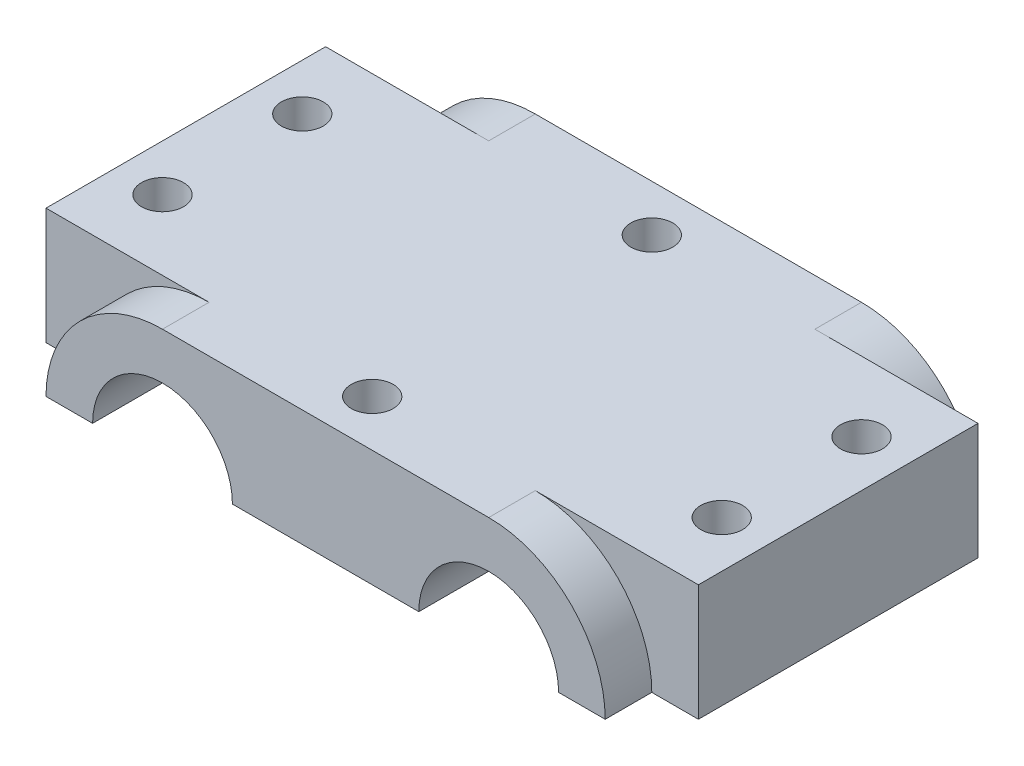
ISO-10303-21;
HEADER;
FILE_DESCRIPTION(('STEP AP214'),'2;1');
FILE_NAME('part.step','',(''),(''),'','','');
FILE_SCHEMA(('AUTOMOTIVE_DESIGN { 1 0 10303 214 1 1 1 1 }'));
ENDSEC;
DATA;
#1=APPLICATION_CONTEXT('core data for automotive mechanical design processes');
#2=APPLICATION_PROTOCOL_DEFINITION('international standard','automotive_design',2000,#1);
#3=PRODUCT_CONTEXT('',#1,'mechanical');
#4=PRODUCT('Part','Part','',(#3));
#5=PRODUCT_RELATED_PRODUCT_CATEGORY('part','',(#4));
#6=PRODUCT_DEFINITION_FORMATION('','',#4);
#7=PRODUCT_DEFINITION_CONTEXT('part definition',#1,'design');
#8=PRODUCT_DEFINITION('design','',#6,#7);
#9=PRODUCT_DEFINITION_SHAPE('','',#8);
#10=(LENGTH_UNIT() NAMED_UNIT(*) SI_UNIT(.MILLI.,.METRE.));
#11=(NAMED_UNIT(*) PLANE_ANGLE_UNIT() SI_UNIT($,.RADIAN.));
#12=(NAMED_UNIT(*) SI_UNIT($,.STERADIAN.) SOLID_ANGLE_UNIT());
#13=UNCERTAINTY_MEASURE_WITH_UNIT(LENGTH_MEASURE(1.E-05),#10,'distance_accuracy_value','');
#14=(GEOMETRIC_REPRESENTATION_CONTEXT(3) GLOBAL_UNCERTAINTY_ASSIGNED_CONTEXT((#13)) GLOBAL_UNIT_ASSIGNED_CONTEXT((#10,
#11,#12)) REPRESENTATION_CONTEXT('',''));
#15=CARTESIAN_POINT('',(0.,0.,0.));
#16=DIRECTION('',(0.,0.,1.));
#17=DIRECTION('',(1.,0.,0.));
#18=AXIS2_PLACEMENT_3D('',#15,#16,#17);
#19=CARTESIAN_POINT('',(0.,-6.25,0.));
#20=DIRECTION('',(0.,-1.,0.));
#21=DIRECTION('',(0.,0.,-1.));
#22=AXIS2_PLACEMENT_3D('',#19,#20,#21);
#23=PLANE('',#22);
#24=CARTESIAN_POINT('',(30.,-6.25,-7.5));
#25=DIRECTION('',(0.,1.,0.));
#26=DIRECTION('',(0.,0.,-1.));
#27=AXIS2_PLACEMENT_3D('',#24,#25,#26);
#28=CIRCLE('',#27,2.25);
#29=CARTESIAN_POINT('',(30.,-6.25,-9.75));
#30=VERTEX_POINT('',#29);
#31=EDGE_CURVE('E330',#30,#30,#28,.T.);
#32=ORIENTED_EDGE('',*,*,#31,.T.);
#33=EDGE_LOOP('',(#32));
#34=FACE_BOUND('',#33,.T.);
#35=CARTESIAN_POINT('',(30.,-6.25,7.5));
#36=DIRECTION('',(0.,1.,0.));
#37=DIRECTION('',(0.,0.,-1.));
#38=AXIS2_PLACEMENT_3D('',#35,#36,#37);
#39=CIRCLE('',#38,2.25);
#40=CARTESIAN_POINT('',(30.,-6.25,5.25));
#41=VERTEX_POINT('',#40);
#42=EDGE_CURVE('E324',#41,#41,#39,.T.);
#43=ORIENTED_EDGE('',*,*,#42,.T.);
#44=EDGE_LOOP('',(#43));
#45=FACE_BOUND('',#44,.T.);
#46=DIRECTION('',(1.,0.,0.));
#47=VECTOR('',#46,1.);
#48=CARTESIAN_POINT('',(0.,-6.25,20.));
#49=LINE('',#48,#47);
#50=CARTESIAN_POINT('',(25.,-6.25,20.));
#51=VERTEX_POINT('',#50);
#52=CARTESIAN_POINT('',(30.,-6.25,20.));
#53=VERTEX_POINT('',#52);
#54=EDGE_CURVE('E182',#51,#53,#49,.T.);
#55=ORIENTED_EDGE('',*,*,#54,.F.);
#56=DIRECTION('',(0.,0.,1.));
#57=VECTOR('',#56,1.);
#58=CARTESIAN_POINT('',(25.,-6.25,-20.));
#59=LINE('',#58,#57);
#60=CARTESIAN_POINT('',(25.,-6.25,-20.));
#61=VERTEX_POINT('',#60);
#62=EDGE_CURVE('E214',#61,#51,#59,.T.);
#63=ORIENTED_EDGE('',*,*,#62,.F.);
#64=DIRECTION('',(1.,0.,0.));
#65=VECTOR('',#64,1.);
#66=CARTESIAN_POINT('',(0.,-6.25,-20.));
#67=LINE('',#66,#65);
#68=CARTESIAN_POINT('',(30.,-6.25,-20.));
#69=VERTEX_POINT('',#68);
#70=EDGE_CURVE('E199',#61,#69,#67,.T.);
#71=ORIENTED_EDGE('',*,*,#70,.T.);
#72=DIRECTION('',(0.,0.,1.));
#73=VECTOR('',#72,1.);
#74=CARTESIAN_POINT('',(30.,-6.25,-20.));
#75=LINE('',#74,#73);
#76=CARTESIAN_POINT('',(30.,-6.25,-15.));
#77=VERTEX_POINT('',#76);
#78=EDGE_CURVE('E210',#69,#77,#75,.T.);
#79=ORIENTED_EDGE('',*,*,#78,.T.);
#80=DIRECTION('',(-1.,0.,0.));
#81=VECTOR('',#80,1.);
#82=CARTESIAN_POINT('',(-35.,-6.25,-15.));
#83=LINE('',#82,#81);
#84=CARTESIAN_POINT('',(35.,-6.25,-15.));
#85=VERTEX_POINT('',#84);
#86=EDGE_CURVE('E249',#85,#77,#83,.T.);
#87=ORIENTED_EDGE('',*,*,#86,.F.);
#88=DIRECTION('',(0.,0.,-1.));
#89=VECTOR('',#88,1.);
#90=CARTESIAN_POINT('',(35.,-6.25,15.));
#91=LINE('',#90,#89);
#92=CARTESIAN_POINT('',(35.,-6.25,15.));
#93=VERTEX_POINT('',#92);
#94=EDGE_CURVE('E233',#93,#85,#91,.T.);
#95=ORIENTED_EDGE('',*,*,#94,.F.);
#96=DIRECTION('',(1.,0.,0.));
#97=VECTOR('',#96,1.);
#98=CARTESIAN_POINT('',(-35.,-6.25,15.));
#99=LINE('',#98,#97);
#100=CARTESIAN_POINT('',(30.,-6.25,15.));
#101=VERTEX_POINT('',#100);
#102=EDGE_CURVE('E254',#101,#93,#99,.T.);
#103=ORIENTED_EDGE('',*,*,#102,.F.);
#104=EDGE_CURVE('E213',#101,#53,#75,.T.);
#105=ORIENTED_EDGE('',*,*,#104,.T.);
#106=EDGE_LOOP('',(#55,#63,#71,#79,#87,#95,#103,#105));
#107=FACE_BOUND('',#106,.T.);
#108=ADVANCED_FACE('F35',(#34,#45,#107),#23,.T.);
#109=CARTESIAN_POINT('',(0.,-6.25,15.));
#110=DIRECTION('',(0.,1.,0.));
#111=DIRECTION('',(0.,0.,-1.));
#112=AXIS2_PLACEMENT_3D('',#109,#110,#111);
#113=CIRCLE('',#112,2.25);
#114=CARTESIAN_POINT('',(0.,-6.25,12.75));
#115=VERTEX_POINT('',#114);
#116=EDGE_CURVE('E341',#115,#115,#113,.T.);
#117=ORIENTED_EDGE('',*,*,#116,.T.);
#118=EDGE_LOOP('',(#117));
#119=FACE_BOUND('',#118,.T.);
#120=CARTESIAN_POINT('',(0.,-6.25,-15.));
#121=DIRECTION('',(0.,1.,0.));
#122=DIRECTION('',(0.,0.,1.));
#123=AXIS2_PLACEMENT_3D('',#120,#121,#122);
#124=CIRCLE('',#123,2.25);
#125=CARTESIAN_POINT('',(0.,-6.25,-12.75));
#126=VERTEX_POINT('',#125);
#127=EDGE_CURVE('E336',#126,#126,#124,.T.);
#128=ORIENTED_EDGE('',*,*,#127,.T.);
#129=EDGE_LOOP('',(#128));
#130=FACE_BOUND('',#129,.T.);
#131=DIRECTION('',(0.,0.,1.));
#132=VECTOR('',#131,1.);
#133=CARTESIAN_POINT('',(10.,-6.25,-20.));
#134=LINE('',#133,#132);
#135=CARTESIAN_POINT('',(10.,-6.25,-20.));
#136=VERTEX_POINT('',#135);
#137=CARTESIAN_POINT('',(10.,-6.25,20.));
#138=VERTEX_POINT('',#137);
#139=EDGE_CURVE('E216',#136,#138,#134,.T.);
#140=ORIENTED_EDGE('',*,*,#139,.T.);
#141=CARTESIAN_POINT('',(-10.,-6.25,20.));
#142=VERTEX_POINT('',#141);
#143=EDGE_CURVE('E183',#142,#138,#49,.T.);
#144=ORIENTED_EDGE('',*,*,#143,.F.);
#145=DIRECTION('',(0.,0.,1.));
#146=VECTOR('',#145,1.);
#147=CARTESIAN_POINT('',(-10.,-6.25,-20.));
#148=LINE('',#147,#146);
#149=CARTESIAN_POINT('',(-10.,-6.25,-20.));
#150=VERTEX_POINT('',#149);
#151=EDGE_CURVE('E218',#150,#142,#148,.T.);
#152=ORIENTED_EDGE('',*,*,#151,.F.);
#153=EDGE_CURVE('E200',#150,#136,#67,.T.);
#154=ORIENTED_EDGE('',*,*,#153,.T.);
#155=EDGE_LOOP('',(#140,#144,#152,#154));
#156=FACE_BOUND('',#155,.T.);
#157=ADVANCED_FACE('F292',(#119,#130,#156),#23,.T.);
#158=CARTESIAN_POINT('',(-35.,6.25,-15.));
#159=DIRECTION('',(0.,0.,1.));
#160=DIRECTION('',(1.,0.,0.));
#161=AXIS2_PLACEMENT_3D('',#158,#159,#160);
#162=PLANE('',#161);
#163=ORIENTED_EDGE('',*,*,#86,.T.);
#164=CARTESIAN_POINT('',(17.5,-6.25,-15.));
#165=DIRECTION('',(0.,0.,1.));
#166=DIRECTION('',(1.,0.,0.));
#167=AXIS2_PLACEMENT_3D('',#164,#165,#166);
#168=CIRCLE('',#167,12.5);
#169=CARTESIAN_POINT('',(17.5,6.25,-15.));
#170=VERTEX_POINT('',#169);
#171=EDGE_CURVE('E230',#77,#170,#168,.T.);
#172=ORIENTED_EDGE('',*,*,#171,.T.);
#173=DIRECTION('',(-1.,0.,0.));
#174=VECTOR('',#173,1.);
#175=CARTESIAN_POINT('',(-35.,6.25,-15.));
#176=LINE('',#175,#174);
#177=CARTESIAN_POINT('',(35.,6.25,-15.));
#178=VERTEX_POINT('',#177);
#179=EDGE_CURVE('E239',#178,#170,#176,.T.);
#180=ORIENTED_EDGE('',*,*,#179,.F.);
#181=DIRECTION('',(0.,-1.,0.));
#182=VECTOR('',#181,1.);
#183=CARTESIAN_POINT('',(35.,6.25,-15.));
#184=LINE('',#183,#182);
#185=EDGE_CURVE('E11',#178,#85,#184,.T.);
#186=ORIENTED_EDGE('',*,*,#185,.T.);
#187=EDGE_LOOP('',(#163,#172,#180,#186));
#188=FACE_BOUND('',#187,.T.);
#189=ADVANCED_FACE('F289',(#188),#162,.F.);
#190=CARTESIAN_POINT('',(-35.,6.25,15.));
#191=DIRECTION('',(0.,0.,-1.));
#192=DIRECTION('',(-1.,0.,0.));
#193=AXIS2_PLACEMENT_3D('',#190,#191,#192);
#194=PLANE('',#193);
#195=DIRECTION('',(1.,0.,0.));
#196=VECTOR('',#195,1.);
#197=CARTESIAN_POINT('',(-35.,6.25,15.));
#198=LINE('',#197,#196);
#199=CARTESIAN_POINT('',(17.5,6.25,15.));
#200=VERTEX_POINT('',#199);
#201=CARTESIAN_POINT('',(35.,6.25,15.));
#202=VERTEX_POINT('',#201);
#203=EDGE_CURVE('E243',#200,#202,#198,.T.);
#204=ORIENTED_EDGE('',*,*,#203,.F.);
#205=CARTESIAN_POINT('',(17.5,-6.25,15.));
#206=DIRECTION('',(0.,0.,-1.));
#207=DIRECTION('',(-1.,0.,0.));
#208=AXIS2_PLACEMENT_3D('',#205,#206,#207);
#209=CIRCLE('',#208,12.5);
#210=EDGE_CURVE('E227',#200,#101,#209,.T.);
#211=ORIENTED_EDGE('',*,*,#210,.T.);
#212=ORIENTED_EDGE('',*,*,#102,.T.);
#213=DIRECTION('',(0.,-1.,0.));
#214=VECTOR('',#213,1.);
#215=CARTESIAN_POINT('',(35.,6.25,15.));
#216=LINE('',#215,#214);
#217=EDGE_CURVE('E245',#202,#93,#216,.T.);
#218=ORIENTED_EDGE('',*,*,#217,.F.);
#219=EDGE_LOOP('',(#204,#211,#212,#218));
#220=FACE_BOUND('',#219,.T.);
#221=ADVANCED_FACE('F278',(#220),#194,.F.);
#222=CARTESIAN_POINT('',(35.,6.25,15.));
#223=DIRECTION('',(-1.,0.,0.));
#224=DIRECTION('',(0.,0.,1.));
#225=AXIS2_PLACEMENT_3D('',#222,#223,#224);
#226=PLANE('',#225);
#227=ORIENTED_EDGE('',*,*,#94,.T.);
#228=ORIENTED_EDGE('',*,*,#185,.F.);
#229=DIRECTION('',(0.,0.,-1.));
#230=VECTOR('',#229,1.);
#231=CARTESIAN_POINT('',(35.,6.25,15.));
#232=LINE('',#231,#230);
#233=EDGE_CURVE('E234',#202,#178,#232,.T.);
#234=ORIENTED_EDGE('',*,*,#233,.F.);
#235=ORIENTED_EDGE('',*,*,#217,.T.);
#236=EDGE_LOOP('',(#227,#228,#234,#235));
#237=FACE_BOUND('',#236,.T.);
#238=ADVANCED_FACE('F37',(#237),#226,.F.);
#239=CARTESIAN_POINT('',(-17.5,6.25,-15.));
#240=VERTEX_POINT('',#239);
#241=CARTESIAN_POINT('',(-35.,6.25,-15.));
#242=VERTEX_POINT('',#241);
#243=EDGE_CURVE('E237',#240,#242,#176,.T.);
#244=ORIENTED_EDGE('',*,*,#243,.F.);
#245=CARTESIAN_POINT('',(-17.5,-6.25,-15.));
#246=DIRECTION('',(0.,0.,1.));
#247=DIRECTION('',(1.,0.,0.));
#248=AXIS2_PLACEMENT_3D('',#245,#246,#247);
#249=CIRCLE('',#248,12.5);
#250=CARTESIAN_POINT('',(-30.,-6.25,-15.));
#251=VERTEX_POINT('',#250);
#252=EDGE_CURVE('E225',#240,#251,#249,.T.);
#253=ORIENTED_EDGE('',*,*,#252,.T.);
#254=CARTESIAN_POINT('',(-35.,-6.25,-15.));
#255=VERTEX_POINT('',#254);
#256=EDGE_CURVE('E248',#251,#255,#83,.T.);
#257=ORIENTED_EDGE('',*,*,#256,.T.);
#258=DIRECTION('',(0.,-1.,0.));
#259=VECTOR('',#258,1.);
#260=CARTESIAN_POINT('',(-35.,6.25,-15.));
#261=LINE('',#260,#259);
#262=EDGE_CURVE('E43',#242,#255,#261,.T.);
#263=ORIENTED_EDGE('',*,*,#262,.F.);
#264=EDGE_LOOP('',(#244,#253,#257,#263));
#265=FACE_BOUND('',#264,.T.);
#266=ADVANCED_FACE('F285',(#265),#162,.F.);
#267=CARTESIAN_POINT('',(-35.,6.25,15.));
#268=DIRECTION('',(1.,0.,0.));
#269=DIRECTION('',(0.,0.,-1.));
#270=AXIS2_PLACEMENT_3D('',#267,#268,#269);
#271=PLANE('',#270);
#272=DIRECTION('',(0.,0.,1.));
#273=VECTOR('',#272,1.);
#274=CARTESIAN_POINT('',(-35.,-6.25,15.));
#275=LINE('',#274,#273);
#276=CARTESIAN_POINT('',(-35.,-6.25,15.));
#277=VERTEX_POINT('',#276);
#278=EDGE_CURVE('E252',#255,#277,#275,.T.);
#279=ORIENTED_EDGE('',*,*,#278,.T.);
#280=DIRECTION('',(0.,-1.,0.));
#281=VECTOR('',#280,1.);
#282=CARTESIAN_POINT('',(-35.,6.25,15.));
#283=LINE('',#282,#281);
#284=CARTESIAN_POINT('',(-35.,6.25,15.));
#285=VERTEX_POINT('',#284);
#286=EDGE_CURVE('E259',#285,#277,#283,.T.);
#287=ORIENTED_EDGE('',*,*,#286,.F.);
#288=DIRECTION('',(0.,0.,1.));
#289=VECTOR('',#288,1.);
#290=CARTESIAN_POINT('',(-35.,6.25,15.));
#291=LINE('',#290,#289);
#292=EDGE_CURVE('E241',#242,#285,#291,.T.);
#293=ORIENTED_EDGE('',*,*,#292,.F.);
#294=ORIENTED_EDGE('',*,*,#262,.T.);
#295=EDGE_LOOP('',(#279,#287,#293,#294));
#296=FACE_BOUND('',#295,.T.);
#297=ADVANCED_FACE('F266',(#296),#271,.F.);
#298=CARTESIAN_POINT('',(-30.,-6.25,15.));
#299=VERTEX_POINT('',#298);
#300=EDGE_CURVE('E238',#277,#299,#99,.T.);
#301=ORIENTED_EDGE('',*,*,#300,.T.);
#302=CARTESIAN_POINT('',(-17.5,-6.25,15.));
#303=DIRECTION('',(0.,0.,-1.));
#304=DIRECTION('',(-1.,0.,0.));
#305=AXIS2_PLACEMENT_3D('',#302,#303,#304);
#306=CIRCLE('',#305,12.5);
#307=CARTESIAN_POINT('',(-17.5,6.25,15.));
#308=VERTEX_POINT('',#307);
#309=EDGE_CURVE('E208',#299,#308,#306,.T.);
#310=ORIENTED_EDGE('',*,*,#309,.T.);
#311=EDGE_CURVE('E154',#285,#308,#198,.T.);
#312=ORIENTED_EDGE('',*,*,#311,.F.);
#313=ORIENTED_EDGE('',*,*,#286,.T.);
#314=EDGE_LOOP('',(#301,#310,#312,#313));
#315=FACE_BOUND('',#314,.T.);
#316=ADVANCED_FACE('F275',(#315),#194,.F.);
#317=CARTESIAN_POINT('',(0.,6.25,0.));
#318=DIRECTION('',(0.,-1.,0.));
#319=DIRECTION('',(0.,0.,-1.));
#320=AXIS2_PLACEMENT_3D('',#317,#318,#319);
#321=PLANE('',#320);
#322=CARTESIAN_POINT('',(0.,6.25,15.));
#323=DIRECTION('',(0.,1.,0.));
#324=DIRECTION('',(0.,0.,-1.));
#325=AXIS2_PLACEMENT_3D('',#322,#323,#324);
#326=CIRCLE('',#325,2.25);
#327=CARTESIAN_POINT('',(0.,6.25,12.75));
#328=VERTEX_POINT('',#327);
#329=EDGE_CURVE('E344',#328,#328,#326,.T.);
#330=ORIENTED_EDGE('',*,*,#329,.F.);
#331=EDGE_LOOP('',(#330));
#332=FACE_BOUND('',#331,.T.);
#333=CARTESIAN_POINT('',(0.,6.25,-15.));
#334=DIRECTION('',(0.,1.,0.));
#335=DIRECTION('',(0.,0.,1.));
#336=AXIS2_PLACEMENT_3D('',#333,#334,#335);
#337=CIRCLE('',#336,2.25);
#338=CARTESIAN_POINT('',(0.,6.25,-12.75));
#339=VERTEX_POINT('',#338);
#340=EDGE_CURVE('E338',#339,#339,#337,.T.);
#341=ORIENTED_EDGE('',*,*,#340,.F.);
#342=EDGE_LOOP('',(#341));
#343=FACE_BOUND('',#342,.T.);
#344=CARTESIAN_POINT('',(30.,6.25,-7.5));
#345=DIRECTION('',(0.,1.,0.));
#346=DIRECTION('',(0.,0.,-1.));
#347=AXIS2_PLACEMENT_3D('',#344,#345,#346);
#348=CIRCLE('',#347,2.25);
#349=CARTESIAN_POINT('',(30.,6.25,-9.75));
#350=VERTEX_POINT('',#349);
#351=EDGE_CURVE('E333',#350,#350,#348,.T.);
#352=ORIENTED_EDGE('',*,*,#351,.F.);
#353=EDGE_LOOP('',(#352));
#354=FACE_BOUND('',#353,.T.);
#355=CARTESIAN_POINT('',(30.,6.25,7.5));
#356=DIRECTION('',(0.,1.,0.));
#357=DIRECTION('',(0.,0.,-1.));
#358=AXIS2_PLACEMENT_3D('',#355,#356,#357);
#359=CIRCLE('',#358,2.25);
#360=CARTESIAN_POINT('',(30.,6.25,5.25));
#361=VERTEX_POINT('',#360);
#362=EDGE_CURVE('E327',#361,#361,#359,.T.);
#363=ORIENTED_EDGE('',*,*,#362,.F.);
#364=EDGE_LOOP('',(#363));
#365=FACE_BOUND('',#364,.T.);
#366=CARTESIAN_POINT('',(-30.,6.25,7.5));
#367=DIRECTION('',(0.,1.,0.));
#368=DIRECTION('',(0.,0.,1.));
#369=AXIS2_PLACEMENT_3D('',#366,#367,#368);
#370=CIRCLE('',#369,2.25);
#371=CARTESIAN_POINT('',(-30.,6.25,9.75));
#372=VERTEX_POINT('',#371);
#373=EDGE_CURVE('E321',#372,#372,#370,.T.);
#374=ORIENTED_EDGE('',*,*,#373,.F.);
#375=EDGE_LOOP('',(#374));
#376=FACE_BOUND('',#375,.T.);
#377=CARTESIAN_POINT('',(-30.,6.25,-7.5));
#378=DIRECTION('',(0.,1.,0.));
#379=DIRECTION('',(0.,0.,1.));
#380=AXIS2_PLACEMENT_3D('',#377,#378,#379);
#381=CIRCLE('',#380,2.25);
#382=CARTESIAN_POINT('',(-30.,6.25,-5.25));
#383=VERTEX_POINT('',#382);
#384=EDGE_CURVE('E176',#383,#383,#381,.T.);
#385=ORIENTED_EDGE('',*,*,#384,.F.);
#386=EDGE_LOOP('',(#385));
#387=FACE_BOUND('',#386,.T.);
#388=ORIENTED_EDGE('',*,*,#179,.T.);
#389=DIRECTION('',(0.,0.,1.));
#390=VECTOR('',#389,1.);
#391=CARTESIAN_POINT('',(17.5,6.25,-20.));
#392=LINE('',#391,#390);
#393=CARTESIAN_POINT('',(17.5,6.25,-20.));
#394=VERTEX_POINT('',#393);
#395=EDGE_CURVE('E206',#394,#170,#392,.T.);
#396=ORIENTED_EDGE('',*,*,#395,.F.);
#397=DIRECTION('',(-1.,0.,0.));
#398=VECTOR('',#397,1.);
#399=CARTESIAN_POINT('',(0.,6.25,-20.));
#400=LINE('',#399,#398);
#401=CARTESIAN_POINT('',(-17.5,6.25,-20.));
#402=VERTEX_POINT('',#401);
#403=EDGE_CURVE('E190',#394,#402,#400,.T.);
#404=ORIENTED_EDGE('',*,*,#403,.T.);
#405=DIRECTION('',(0.,0.,1.));
#406=VECTOR('',#405,1.);
#407=CARTESIAN_POINT('',(-17.5,6.25,-20.));
#408=LINE('',#407,#406);
#409=EDGE_CURVE('E155',#402,#240,#408,.T.);
#410=ORIENTED_EDGE('',*,*,#409,.T.);
#411=ORIENTED_EDGE('',*,*,#243,.T.);
#412=ORIENTED_EDGE('',*,*,#292,.T.);
#413=ORIENTED_EDGE('',*,*,#311,.T.);
#414=CARTESIAN_POINT('',(-17.5,6.25,20.));
#415=VERTEX_POINT('',#414);
#416=EDGE_CURVE('E50',#308,#415,#408,.T.);
#417=ORIENTED_EDGE('',*,*,#416,.T.);
#418=DIRECTION('',(-1.,0.,0.));
#419=VECTOR('',#418,1.);
#420=CARTESIAN_POINT('',(0.,6.25,20.));
#421=LINE('',#420,#419);
#422=CARTESIAN_POINT('',(17.5,6.25,20.));
#423=VERTEX_POINT('',#422);
#424=EDGE_CURVE('E152',#423,#415,#421,.T.);
#425=ORIENTED_EDGE('',*,*,#424,.F.);
#426=EDGE_CURVE('E209',#200,#423,#392,.T.);
#427=ORIENTED_EDGE('',*,*,#426,.F.);
#428=ORIENTED_EDGE('',*,*,#203,.T.);
#429=ORIENTED_EDGE('',*,*,#233,.T.);
#430=EDGE_LOOP('',(#388,#396,#404,#410,#411,#412,#413,#417,#425,#427,#428,#429));
#431=FACE_BOUND('',#430,.T.);
#432=ADVANCED_FACE('F149',(#332,#343,#354,#365,#376,#387,#431),#321,.F.);
#433=CARTESIAN_POINT('',(-30.,-6.25,7.5));
#434=DIRECTION('',(0.,1.,0.));
#435=DIRECTION('',(0.,0.,1.));
#436=AXIS2_PLACEMENT_3D('',#433,#434,#435);
#437=CIRCLE('',#436,2.25);
#438=CARTESIAN_POINT('',(-30.,-6.25,9.75));
#439=VERTEX_POINT('',#438);
#440=EDGE_CURVE('E309',#439,#439,#437,.T.);
#441=ORIENTED_EDGE('',*,*,#440,.T.);
#442=EDGE_LOOP('',(#441));
#443=FACE_BOUND('',#442,.T.);
#444=CARTESIAN_POINT('',(-30.,-6.25,-7.5));
#445=DIRECTION('',(0.,1.,0.));
#446=DIRECTION('',(0.,0.,1.));
#447=AXIS2_PLACEMENT_3D('',#444,#445,#446);
#448=CIRCLE('',#447,2.25);
#449=CARTESIAN_POINT('',(-30.,-6.25,-5.25));
#450=VERTEX_POINT('',#449);
#451=EDGE_CURVE('E173',#450,#450,#448,.T.);
#452=ORIENTED_EDGE('',*,*,#451,.T.);
#453=EDGE_LOOP('',(#452));
#454=FACE_BOUND('',#453,.T.);
#455=DIRECTION('',(0.,0.,1.));
#456=VECTOR('',#455,1.);
#457=CARTESIAN_POINT('',(-25.,-6.25,-20.));
#458=LINE('',#457,#456);
#459=CARTESIAN_POINT('',(-25.,-6.25,-20.));
#460=VERTEX_POINT('',#459);
#461=CARTESIAN_POINT('',(-25.,-6.25,20.));
#462=VERTEX_POINT('',#461);
#463=EDGE_CURVE('E220',#460,#462,#458,.T.);
#464=ORIENTED_EDGE('',*,*,#463,.T.);
#465=CARTESIAN_POINT('',(-30.,-6.25,20.));
#466=VERTEX_POINT('',#465);
#467=EDGE_CURVE('E166',#466,#462,#49,.T.);
#468=ORIENTED_EDGE('',*,*,#467,.F.);
#469=DIRECTION('',(0.,0.,1.));
#470=VECTOR('',#469,1.);
#471=CARTESIAN_POINT('',(-30.,-6.25,-20.));
#472=LINE('',#471,#470);
#473=EDGE_CURVE('E162',#299,#466,#472,.T.);
#474=ORIENTED_EDGE('',*,*,#473,.F.);
#475=ORIENTED_EDGE('',*,*,#300,.F.);
#476=ORIENTED_EDGE('',*,*,#278,.F.);
#477=ORIENTED_EDGE('',*,*,#256,.F.);
#478=CARTESIAN_POINT('',(-30.,-6.25,-20.));
#479=VERTEX_POINT('',#478);
#480=EDGE_CURVE('E58',#479,#251,#472,.T.);
#481=ORIENTED_EDGE('',*,*,#480,.F.);
#482=EDGE_CURVE('E195',#479,#460,#67,.T.);
#483=ORIENTED_EDGE('',*,*,#482,.T.);
#484=EDGE_LOOP('',(#464,#468,#474,#475,#476,#477,#481,#483));
#485=FACE_BOUND('',#484,.T.);
#486=ADVANCED_FACE('F273',(#443,#454,#485),#23,.T.);
#487=CARTESIAN_POINT('',(0.,0.,20.));
#488=DIRECTION('',(0.,0.,1.));
#489=DIRECTION('',(1.,0.,0.));
#490=AXIS2_PLACEMENT_3D('',#487,#488,#489);
#491=PLANE('',#490);
#492=ORIENTED_EDGE('',*,*,#424,.T.);
#493=CARTESIAN_POINT('',(-17.5,-6.25,20.));
#494=DIRECTION('',(0.,0.,1.));
#495=DIRECTION('',(1.,0.,0.));
#496=AXIS2_PLACEMENT_3D('',#493,#494,#495);
#497=CIRCLE('',#496,12.5);
#498=EDGE_CURVE('E159',#415,#466,#497,.T.);
#499=ORIENTED_EDGE('',*,*,#498,.T.);
#500=ORIENTED_EDGE('',*,*,#467,.T.);
#501=CARTESIAN_POINT('',(-17.5,-6.25,20.));
#502=DIRECTION('',(0.,0.,1.));
#503=DIRECTION('',(1.,0.,0.));
#504=AXIS2_PLACEMENT_3D('',#501,#502,#503);
#505=CIRCLE('',#504,7.5);
#506=EDGE_CURVE('E181',#142,#462,#505,.T.);
#507=ORIENTED_EDGE('',*,*,#506,.F.);
#508=ORIENTED_EDGE('',*,*,#143,.T.);
#509=CARTESIAN_POINT('',(17.5,-6.25,20.));
#510=DIRECTION('',(0.,0.,1.));
#511=DIRECTION('',(1.,0.,0.));
#512=AXIS2_PLACEMENT_3D('',#509,#510,#511);
#513=CIRCLE('',#512,7.5);
#514=EDGE_CURVE('E186',#51,#138,#513,.T.);
#515=ORIENTED_EDGE('',*,*,#514,.F.);
#516=ORIENTED_EDGE('',*,*,#54,.T.);
#517=CARTESIAN_POINT('',(17.5,-6.25,20.));
#518=DIRECTION('',(0.,0.,1.));
#519=DIRECTION('',(1.,0.,0.));
#520=AXIS2_PLACEMENT_3D('',#517,#518,#519);
#521=CIRCLE('',#520,12.5);
#522=EDGE_CURVE('E172',#53,#423,#521,.T.);
#523=ORIENTED_EDGE('',*,*,#522,.T.);
#524=EDGE_LOOP('',(#492,#499,#500,#507,#508,#515,#516,#523));
#525=FACE_BOUND('',#524,.T.);
#526=ADVANCED_FACE('F169',(#525),#491,.T.);
#527=CARTESIAN_POINT('',(-17.5,-6.25,-20.));
#528=DIRECTION('',(0.,0.,1.));
#529=DIRECTION('',(1.,0.,0.));
#530=AXIS2_PLACEMENT_3D('',#527,#528,#529);
#531=CYLINDRICAL_SURFACE('',#530,12.5);
#532=ORIENTED_EDGE('',*,*,#309,.F.);
#533=ORIENTED_EDGE('',*,*,#473,.T.);
#534=ORIENTED_EDGE('',*,*,#498,.F.);
#535=ORIENTED_EDGE('',*,*,#416,.F.);
#536=EDGE_LOOP('',(#532,#533,#534,#535));
#537=FACE_BOUND('',#536,.T.);
#538=ADVANCED_FACE('F160',(#537),#531,.T.);
#539=CARTESIAN_POINT('',(17.5,-6.25,-20.));
#540=DIRECTION('',(0.,0.,1.));
#541=DIRECTION('',(1.,0.,0.));
#542=AXIS2_PLACEMENT_3D('',#539,#540,#541);
#543=CYLINDRICAL_SURFACE('',#542,12.5);
#544=ORIENTED_EDGE('',*,*,#210,.F.);
#545=ORIENTED_EDGE('',*,*,#426,.T.);
#546=ORIENTED_EDGE('',*,*,#522,.F.);
#547=ORIENTED_EDGE('',*,*,#104,.F.);
#548=EDGE_LOOP('',(#544,#545,#546,#547));
#549=FACE_BOUND('',#548,.T.);
#550=ADVANCED_FACE('F386',(#549),#543,.T.);
#551=ORIENTED_EDGE('',*,*,#171,.F.);
#552=ORIENTED_EDGE('',*,*,#78,.F.);
#553=CARTESIAN_POINT('',(17.5,-6.25,-20.));
#554=DIRECTION('',(0.,0.,1.));
#555=DIRECTION('',(1.,0.,0.));
#556=AXIS2_PLACEMENT_3D('',#553,#554,#555);
#557=CIRCLE('',#556,12.5);
#558=EDGE_CURVE('E156',#69,#394,#557,.T.);
#559=ORIENTED_EDGE('',*,*,#558,.T.);
#560=ORIENTED_EDGE('',*,*,#395,.T.);
#561=EDGE_LOOP('',(#551,#552,#559,#560));
#562=FACE_BOUND('',#561,.T.);
#563=ADVANCED_FACE('F382',(#562),#543,.T.);
#564=CARTESIAN_POINT('',(17.5,-6.25,-20.));
#565=DIRECTION('',(0.,0.,1.));
#566=DIRECTION('',(1.,0.,0.));
#567=AXIS2_PLACEMENT_3D('',#564,#565,#566);
#568=CYLINDRICAL_SURFACE('',#567,7.5);
#569=ORIENTED_EDGE('',*,*,#62,.T.);
#570=ORIENTED_EDGE('',*,*,#514,.T.);
#571=ORIENTED_EDGE('',*,*,#139,.F.);
#572=CARTESIAN_POINT('',(17.5,-6.25,-20.));
#573=DIRECTION('',(0.,0.,1.));
#574=DIRECTION('',(1.,0.,0.));
#575=AXIS2_PLACEMENT_3D('',#572,#573,#574);
#576=CIRCLE('',#575,7.5);
#577=EDGE_CURVE('E202',#61,#136,#576,.T.);
#578=ORIENTED_EDGE('',*,*,#577,.F.);
#579=EDGE_LOOP('',(#569,#570,#571,#578));
#580=FACE_BOUND('',#579,.T.);
#581=ADVANCED_FACE('F385',(#580),#568,.F.);
#582=CARTESIAN_POINT('',(-17.5,-6.25,-20.));
#583=DIRECTION('',(0.,0.,1.));
#584=DIRECTION('',(1.,0.,0.));
#585=AXIS2_PLACEMENT_3D('',#582,#583,#584);
#586=CYLINDRICAL_SURFACE('',#585,7.5);
#587=ORIENTED_EDGE('',*,*,#151,.T.);
#588=ORIENTED_EDGE('',*,*,#506,.T.);
#589=ORIENTED_EDGE('',*,*,#463,.F.);
#590=CARTESIAN_POINT('',(-17.5,-6.25,-20.));
#591=DIRECTION('',(0.,0.,1.));
#592=DIRECTION('',(1.,0.,0.));
#593=AXIS2_PLACEMENT_3D('',#590,#591,#592);
#594=CIRCLE('',#593,7.5);
#595=EDGE_CURVE('E198',#150,#460,#594,.T.);
#596=ORIENTED_EDGE('',*,*,#595,.F.);
#597=EDGE_LOOP('',(#587,#588,#589,#596));
#598=FACE_BOUND('',#597,.T.);
#599=ADVANCED_FACE('F390',(#598),#586,.F.);
#600=ORIENTED_EDGE('',*,*,#252,.F.);
#601=ORIENTED_EDGE('',*,*,#409,.F.);
#602=CARTESIAN_POINT('',(-17.5,-6.25,-20.));
#603=DIRECTION('',(0.,0.,1.));
#604=DIRECTION('',(1.,0.,0.));
#605=AXIS2_PLACEMENT_3D('',#602,#603,#604);
#606=CIRCLE('',#605,12.5);
#607=EDGE_CURVE('E193',#402,#479,#606,.T.);
#608=ORIENTED_EDGE('',*,*,#607,.T.);
#609=ORIENTED_EDGE('',*,*,#480,.T.);
#610=EDGE_LOOP('',(#600,#601,#608,#609));
#611=FACE_BOUND('',#610,.T.);
#612=ADVANCED_FACE('F380',(#611),#531,.T.);
#613=CARTESIAN_POINT('',(0.,0.,-20.));
#614=DIRECTION('',(0.,0.,1.));
#615=DIRECTION('',(1.,0.,0.));
#616=AXIS2_PLACEMENT_3D('',#613,#614,#615);
#617=PLANE('',#616);
#618=ORIENTED_EDGE('',*,*,#403,.F.);
#619=ORIENTED_EDGE('',*,*,#558,.F.);
#620=ORIENTED_EDGE('',*,*,#70,.F.);
#621=ORIENTED_EDGE('',*,*,#577,.T.);
#622=ORIENTED_EDGE('',*,*,#153,.F.);
#623=ORIENTED_EDGE('',*,*,#595,.T.);
#624=ORIENTED_EDGE('',*,*,#482,.F.);
#625=ORIENTED_EDGE('',*,*,#607,.F.);
#626=EDGE_LOOP('',(#618,#619,#620,#621,#622,#623,#624,#625));
#627=FACE_BOUND('',#626,.T.);
#628=ADVANCED_FACE('F316',(#627),#617,.F.);
#629=CARTESIAN_POINT('',(-30.,-6.25,-7.5));
#630=DIRECTION('',(0.,1.,0.));
#631=DIRECTION('',(0.,0.,1.));
#632=AXIS2_PLACEMENT_3D('',#629,#630,#631);
#633=CYLINDRICAL_SURFACE('',#632,2.25);
#634=ORIENTED_EDGE('',*,*,#451,.F.);
#635=EDGE_LOOP('',(#634));
#636=FACE_BOUND('',#635,.T.);
#637=ORIENTED_EDGE('',*,*,#384,.T.);
#638=EDGE_LOOP('',(#637));
#639=FACE_BOUND('',#638,.T.);
#640=ADVANCED_FACE('F312',(#636,#639),#633,.F.);
#641=CARTESIAN_POINT('',(-30.,-6.25,7.5));
#642=DIRECTION('',(0.,1.,0.));
#643=DIRECTION('',(0.,0.,1.));
#644=AXIS2_PLACEMENT_3D('',#641,#642,#643);
#645=CYLINDRICAL_SURFACE('',#644,2.25);
#646=ORIENTED_EDGE('',*,*,#440,.F.);
#647=EDGE_LOOP('',(#646));
#648=FACE_BOUND('',#647,.T.);
#649=ORIENTED_EDGE('',*,*,#373,.T.);
#650=EDGE_LOOP('',(#649));
#651=FACE_BOUND('',#650,.T.);
#652=ADVANCED_FACE('F315',(#648,#651),#645,.F.);
#653=CARTESIAN_POINT('',(30.,-6.25,7.5));
#654=DIRECTION('',(0.,1.,0.));
#655=DIRECTION('',(0.,0.,1.));
#656=AXIS2_PLACEMENT_3D('',#653,#654,#655);
#657=CYLINDRICAL_SURFACE('',#656,2.25);
#658=ORIENTED_EDGE('',*,*,#42,.F.);
#659=EDGE_LOOP('',(#658));
#660=FACE_BOUND('',#659,.T.);
#661=ORIENTED_EDGE('',*,*,#362,.T.);
#662=EDGE_LOOP('',(#661));
#663=FACE_BOUND('',#662,.T.);
#664=ADVANCED_FACE('F367',(#660,#663),#657,.F.);
#665=CARTESIAN_POINT('',(30.,-6.25,-7.5));
#666=DIRECTION('',(0.,1.,0.));
#667=DIRECTION('',(0.,0.,1.));
#668=AXIS2_PLACEMENT_3D('',#665,#666,#667);
#669=CYLINDRICAL_SURFACE('',#668,2.25);
#670=ORIENTED_EDGE('',*,*,#31,.F.);
#671=EDGE_LOOP('',(#670));
#672=FACE_BOUND('',#671,.T.);
#673=ORIENTED_EDGE('',*,*,#351,.T.);
#674=EDGE_LOOP('',(#673));
#675=FACE_BOUND('',#674,.T.);
#676=ADVANCED_FACE('F373',(#672,#675),#669,.F.);
#677=CARTESIAN_POINT('',(0.,-6.25,-15.));
#678=DIRECTION('',(0.,1.,0.));
#679=DIRECTION('',(0.,0.,1.));
#680=AXIS2_PLACEMENT_3D('',#677,#678,#679);
#681=CYLINDRICAL_SURFACE('',#680,2.25);
#682=ORIENTED_EDGE('',*,*,#127,.F.);
#683=EDGE_LOOP('',(#682));
#684=FACE_BOUND('',#683,.T.);
#685=ORIENTED_EDGE('',*,*,#340,.T.);
#686=EDGE_LOOP('',(#685));
#687=FACE_BOUND('',#686,.T.);
#688=ADVANCED_FACE('F354',(#684,#687),#681,.F.);
#689=CARTESIAN_POINT('',(0.,-6.25,15.));
#690=DIRECTION('',(0.,1.,0.));
#691=DIRECTION('',(0.,0.,1.));
#692=AXIS2_PLACEMENT_3D('',#689,#690,#691);
#693=CYLINDRICAL_SURFACE('',#692,2.25);
#694=ORIENTED_EDGE('',*,*,#116,.F.);
#695=EDGE_LOOP('',(#694));
#696=FACE_BOUND('',#695,.T.);
#697=ORIENTED_EDGE('',*,*,#329,.T.);
#698=EDGE_LOOP('',(#697));
#699=FACE_BOUND('',#698,.T.);
#700=ADVANCED_FACE('F351',(#696,#699),#693,.F.);
#701=CLOSED_SHELL('',(#108,#157,#189,#221,#238,#266,#297,#316,#432,#486,#526,#538,#550,#563,
#581,#599,#612,#628,#640,#652,#664,#676,#688,#700));
#702=MANIFOLD_SOLID_BREP('B2',#701);
#703=ADVANCED_BREP_SHAPE_REPRESENTATION('',(#18,#702),#14);
#704=SHAPE_DEFINITION_REPRESENTATION(#9,#703);
ENDSEC;
END-ISO-10303-21;
